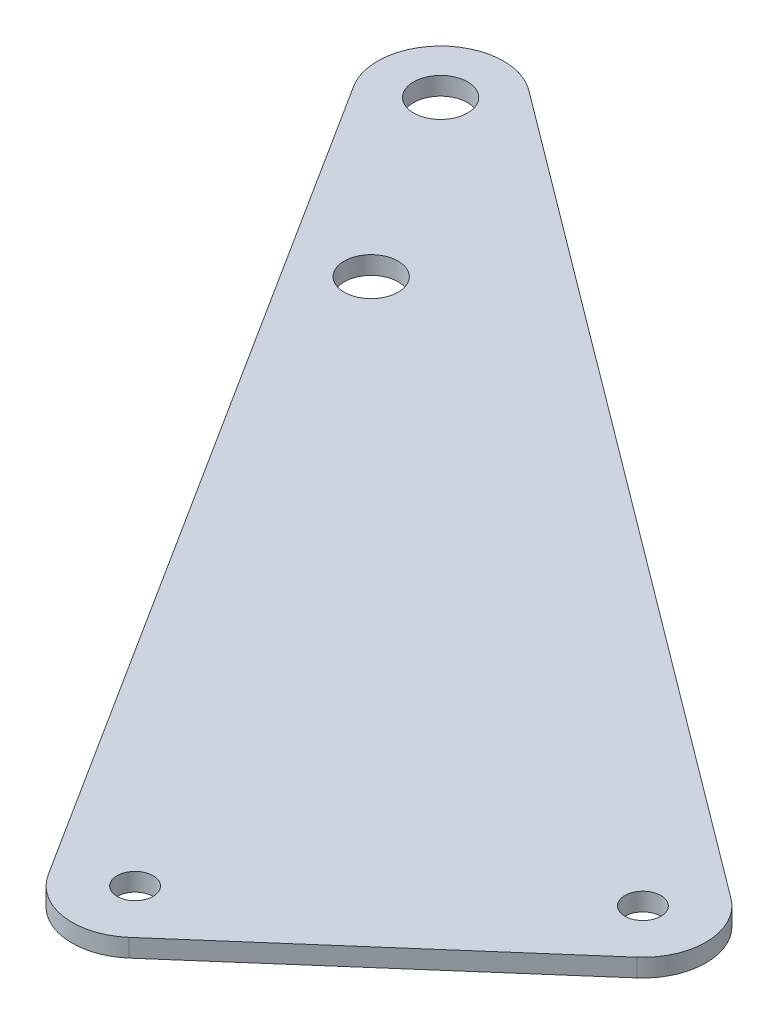
ISO-10303-21;
HEADER;
FILE_DESCRIPTION(('STEP AP214'),'2;1');
FILE_NAME('part.step','',(''),(''),'','','');
FILE_SCHEMA(('AUTOMOTIVE_DESIGN { 1 0 10303 214 1 1 1 1 }'));
ENDSEC;
DATA;
#1=APPLICATION_CONTEXT('core data for automotive mechanical design processes');
#2=APPLICATION_PROTOCOL_DEFINITION('international standard','automotive_design',2000,#1);
#3=PRODUCT_CONTEXT('',#1,'mechanical');
#4=PRODUCT('Part','Part','',(#3));
#5=PRODUCT_RELATED_PRODUCT_CATEGORY('part','',(#4));
#6=PRODUCT_DEFINITION_FORMATION('','',#4);
#7=PRODUCT_DEFINITION_CONTEXT('part definition',#1,'design');
#8=PRODUCT_DEFINITION('design','',#6,#7);
#9=PRODUCT_DEFINITION_SHAPE('','',#8);
#10=(LENGTH_UNIT() NAMED_UNIT(*) SI_UNIT(.MILLI.,.METRE.));
#11=(NAMED_UNIT(*) PLANE_ANGLE_UNIT() SI_UNIT($,.RADIAN.));
#12=(NAMED_UNIT(*) SI_UNIT($,.STERADIAN.) SOLID_ANGLE_UNIT());
#13=UNCERTAINTY_MEASURE_WITH_UNIT(LENGTH_MEASURE(1.E-05),#10,'distance_accuracy_value','');
#14=(GEOMETRIC_REPRESENTATION_CONTEXT(3) GLOBAL_UNCERTAINTY_ASSIGNED_CONTEXT((#13)) GLOBAL_UNIT_ASSIGNED_CONTEXT((#10,
#11,#12)) REPRESENTATION_CONTEXT('',''));
#15=CARTESIAN_POINT('',(0.,0.,0.));
#16=DIRECTION('',(0.,0.,1.));
#17=DIRECTION('',(1.,0.,0.));
#18=AXIS2_PLACEMENT_3D('',#15,#16,#17);
#19=CARTESIAN_POINT('',(1696.36798293908,2.,-948.360954862858));
#20=DIRECTION('',(0.,1.,0.));
#21=DIRECTION('',(0.,0.,-1.));
#22=AXIS2_PLACEMENT_3D('',#19,#20,#21);
#23=PLANE('',#22);
#24=CARTESIAN_POINT('',(1696.36798293908,2.,-948.360954862858));
#25=DIRECTION('',(0.,-1.,0.));
#26=DIRECTION('',(0.,0.,-1.));
#27=AXIS2_PLACEMENT_3D('',#24,#25,#26);
#28=CIRCLE('',#27,2.99999999999994);
#29=CARTESIAN_POINT('',(1696.36798293908,2.,-951.360954862858));
#30=VERTEX_POINT('',#29);
#31=EDGE_CURVE('E160',#30,#30,#28,.T.);
#32=ORIENTED_EDGE('',*,*,#31,.T.);
#33=EDGE_LOOP('',(#32));
#34=FACE_BOUND('',#33,.T.);
#35=CARTESIAN_POINT('',(1755.29624866515,2.,-855.476836206733));
#36=DIRECTION('',(0.,-1.,0.));
#37=DIRECTION('',(0.,0.,-1.));
#38=AXIS2_PLACEMENT_3D('',#35,#36,#37);
#39=CIRCLE('',#38,2.0000000000001);
#40=CARTESIAN_POINT('',(1755.29624866515,2.,-857.476836206733));
#41=VERTEX_POINT('',#40);
#42=EDGE_CURVE('E126',#41,#41,#39,.T.);
#43=ORIENTED_EDGE('',*,*,#42,.T.);
#44=EDGE_LOOP('',(#43));
#45=FACE_BOUND('',#44,.T.);
#46=CARTESIAN_POINT('',(1696.36798293908,2.,-948.360954862858));
#47=DIRECTION('',(0.,-1.,0.));
#48=DIRECTION('',(0.,0.,-1.));
#49=AXIS2_PLACEMENT_3D('',#46,#47,#48);
#50=CIRCLE('',#49,7.00000000000001);
#51=CARTESIAN_POINT('',(1690.45717538824,2.,-944.610974316654));
#52=VERTEX_POINT('',#51);
#53=CARTESIAN_POINT('',(1700.55912281539,2.,-953.967589016899));
#54=VERTEX_POINT('',#53);
#55=EDGE_CURVE('E137',#52,#54,#50,.T.);
#56=ORIENTED_EDGE('',*,*,#55,.F.);
#57=DIRECTION('',(-0.535711506600463,0.,-0.844401078691792));
#58=VECTOR('',#57,1.);
#59=CARTESIAN_POINT('',(1690.45717538824,2.,-944.610974316654));
#60=LINE('',#59,#58);
#61=CARTESIAN_POINT('',(1749.38544111431,2.,-851.726855660529));
#62=VERTEX_POINT('',#61);
#63=EDGE_CURVE('E117',#62,#52,#60,.T.);
#64=ORIENTED_EDGE('',*,*,#63,.F.);
#65=CARTESIAN_POINT('',(1755.29624866515,2.,-855.476836206733));
#66=DIRECTION('',(0.,-1.,0.));
#67=DIRECTION('',(0.,0.,-1.));
#68=AXIS2_PLACEMENT_3D('',#65,#66,#67);
#69=CIRCLE('',#68,6.99999999999992);
#70=CARTESIAN_POINT('',(1759.90080197654,2.,-850.204446918886));
#71=VERTEX_POINT('',#70);
#72=EDGE_CURVE('E98',#71,#62,#69,.T.);
#73=ORIENTED_EDGE('',*,*,#72,.F.);
#74=DIRECTION('',(-0.753198469692406,0.,0.657793330198033));
#75=VECTOR('',#74,1.);
#76=CARTESIAN_POINT('',(1790.02874076423,2.,-876.516180126807));
#77=LINE('',#76,#75);
#78=CARTESIAN_POINT('',(1790.02874076423,2.,-876.516180126807));
#79=VERTEX_POINT('',#78);
#80=EDGE_CURVE('E108',#79,#71,#77,.T.);
#81=ORIENTED_EDGE('',*,*,#80,.F.);
#82=CARTESIAN_POINT('',(1785.42418745285,2.,-881.788569414654));
#83=DIRECTION('',(0.,-1.,0.));
#84=DIRECTION('',(0.,0.,-1.));
#85=AXIS2_PLACEMENT_3D('',#82,#83,#84);
#86=CIRCLE('',#85,6.99999999999997);
#87=CARTESIAN_POINT('',(1789.61532732915,2.,-887.395203568695));
#88=VERTEX_POINT('',#87);
#89=EDGE_CURVE('E113',#88,#79,#86,.T.);
#90=ORIENTED_EDGE('',*,*,#89,.F.);
#91=DIRECTION('',(0.800947736291568,0.,0.598734268043356));
#92=VECTOR('',#91,1.);
#93=CARTESIAN_POINT('',(1700.55912281539,2.,-953.967589016899));
#94=LINE('',#93,#92);
#95=EDGE_CURVE('E142',#54,#88,#94,.T.);
#96=ORIENTED_EDGE('',*,*,#95,.F.);
#97=EDGE_LOOP('',(#56,#64,#73,#81,#90,#96));
#98=FACE_BOUND('',#97,.T.);
#99=CARTESIAN_POINT('',(1785.42418745285,2.,-881.788569414654));
#100=DIRECTION('',(0.,-1.,0.));
#101=DIRECTION('',(0.,0.,-1.));
#102=AXIS2_PLACEMENT_3D('',#99,#100,#101);
#103=CIRCLE('',#102,2.0000000000001);
#104=CARTESIAN_POINT('',(1785.42418745285,2.,-883.788569414654));
#105=VERTEX_POINT('',#104);
#106=EDGE_CURVE('E154',#105,#105,#103,.T.);
#107=ORIENTED_EDGE('',*,*,#106,.T.);
#108=EDGE_LOOP('',(#107));
#109=FACE_BOUND('',#108,.T.);
#110=CARTESIAN_POINT('',(1709.76077060409,2.,-927.250927895563));
#111=DIRECTION('',(0.,-1.,0.));
#112=DIRECTION('',(0.,0.,-1.));
#113=AXIS2_PLACEMENT_3D('',#110,#111,#112);
#114=CIRCLE('',#113,2.99999999999994);
#115=CARTESIAN_POINT('',(1709.76077060409,2.,-930.250927895563));
#116=VERTEX_POINT('',#115);
#117=EDGE_CURVE('E166',#116,#116,#114,.T.);
#118=ORIENTED_EDGE('',*,*,#117,.T.);
#119=EDGE_LOOP('',(#118));
#120=FACE_BOUND('',#119,.T.);
#121=ADVANCED_FACE('F37',(#34,#45,#98,#109,#120),#23,.T.);
#122=CARTESIAN_POINT('',(1696.36798293908,0.,-948.360954862858));
#123=DIRECTION('',(0.,1.,0.));
#124=DIRECTION('',(0.,0.,-1.));
#125=AXIS2_PLACEMENT_3D('',#122,#123,#124);
#126=PLANE('',#125);
#127=CARTESIAN_POINT('',(1696.36798293908,0.,-948.360954862858));
#128=DIRECTION('',(0.,-1.,0.));
#129=DIRECTION('',(0.,0.,-1.));
#130=AXIS2_PLACEMENT_3D('',#127,#128,#129);
#131=CIRCLE('',#130,7.00000000000001);
#132=CARTESIAN_POINT('',(1690.45717538824,0.,-944.610974316654));
#133=VERTEX_POINT('',#132);
#134=CARTESIAN_POINT('',(1700.55912281539,0.,-953.967589016899));
#135=VERTEX_POINT('',#134);
#136=EDGE_CURVE('E122',#133,#135,#131,.T.);
#137=ORIENTED_EDGE('',*,*,#136,.T.);
#138=DIRECTION('',(0.800947736291568,0.,0.598734268043356));
#139=VECTOR('',#138,1.);
#140=CARTESIAN_POINT('',(1700.55912281539,0.,-953.967589016899));
#141=LINE('',#140,#139);
#142=CARTESIAN_POINT('',(1789.61532732915,0.,-887.395203568695));
#143=VERTEX_POINT('',#142);
#144=EDGE_CURVE('E125',#135,#143,#141,.T.);
#145=ORIENTED_EDGE('',*,*,#144,.T.);
#146=CARTESIAN_POINT('',(1785.42418745285,0.,-881.788569414654));
#147=DIRECTION('',(0.,-1.,0.));
#148=DIRECTION('',(0.,0.,-1.));
#149=AXIS2_PLACEMENT_3D('',#146,#147,#148);
#150=CIRCLE('',#149,6.99999999999997);
#151=CARTESIAN_POINT('',(1790.02874076423,0.,-876.516180126807));
#152=VERTEX_POINT('',#151);
#153=EDGE_CURVE('E129',#143,#152,#150,.T.);
#154=ORIENTED_EDGE('',*,*,#153,.T.);
#155=DIRECTION('',(-0.753198469692406,0.,0.657793330198033));
#156=VECTOR('',#155,1.);
#157=CARTESIAN_POINT('',(1790.02874076423,0.,-876.516180126807));
#158=LINE('',#157,#156);
#159=CARTESIAN_POINT('',(1759.90080197654,0.,-850.204446918886));
#160=VERTEX_POINT('',#159);
#161=EDGE_CURVE('E132',#152,#160,#158,.T.);
#162=ORIENTED_EDGE('',*,*,#161,.T.);
#163=CARTESIAN_POINT('',(1755.29624866515,0.,-855.476836206733));
#164=DIRECTION('',(0.,-1.,0.));
#165=DIRECTION('',(0.,0.,-1.));
#166=AXIS2_PLACEMENT_3D('',#163,#164,#165);
#167=CIRCLE('',#166,6.99999999999992);
#168=CARTESIAN_POINT('',(1749.38544111431,0.,-851.726855660529));
#169=VERTEX_POINT('',#168);
#170=EDGE_CURVE('E101',#160,#169,#167,.T.);
#171=ORIENTED_EDGE('',*,*,#170,.T.);
#172=DIRECTION('',(-0.535711506600463,0.,-0.844401078691792));
#173=VECTOR('',#172,1.);
#174=CARTESIAN_POINT('',(1690.45717538824,0.,-944.610974316654));
#175=LINE('',#174,#173);
#176=EDGE_CURVE('E135',#169,#133,#175,.T.);
#177=ORIENTED_EDGE('',*,*,#176,.T.);
#178=EDGE_LOOP('',(#137,#145,#154,#162,#171,#177));
#179=FACE_BOUND('',#178,.T.);
#180=CARTESIAN_POINT('',(1755.29624866515,0.,-855.476836206733));
#181=DIRECTION('',(0.,-1.,0.));
#182=DIRECTION('',(0.,0.,-1.));
#183=AXIS2_PLACEMENT_3D('',#180,#181,#182);
#184=CIRCLE('',#183,2.0000000000001);
#185=CARTESIAN_POINT('',(1755.29624866515,0.,-857.476836206733));
#186=VERTEX_POINT('',#185);
#187=EDGE_CURVE('E151',#186,#186,#184,.T.);
#188=ORIENTED_EDGE('',*,*,#187,.F.);
#189=EDGE_LOOP('',(#188));
#190=FACE_BOUND('',#189,.T.);
#191=CARTESIAN_POINT('',(1785.42418745285,0.,-881.788569414654));
#192=DIRECTION('',(0.,-1.,0.));
#193=DIRECTION('',(0.,0.,-1.));
#194=AXIS2_PLACEMENT_3D('',#191,#192,#193);
#195=CIRCLE('',#194,2.0000000000001);
#196=CARTESIAN_POINT('',(1785.42418745285,0.,-883.788569414654));
#197=VERTEX_POINT('',#196);
#198=EDGE_CURVE('E157',#197,#197,#195,.T.);
#199=ORIENTED_EDGE('',*,*,#198,.F.);
#200=EDGE_LOOP('',(#199));
#201=FACE_BOUND('',#200,.T.);
#202=CARTESIAN_POINT('',(1696.36798293908,0.,-948.360954862858));
#203=DIRECTION('',(0.,-1.,0.));
#204=DIRECTION('',(0.,0.,-1.));
#205=AXIS2_PLACEMENT_3D('',#202,#203,#204);
#206=CIRCLE('',#205,2.99999999999994);
#207=CARTESIAN_POINT('',(1696.36798293908,0.,-951.360954862858));
#208=VERTEX_POINT('',#207);
#209=EDGE_CURVE('E163',#208,#208,#206,.T.);
#210=ORIENTED_EDGE('',*,*,#209,.F.);
#211=EDGE_LOOP('',(#210));
#212=FACE_BOUND('',#211,.T.);
#213=CARTESIAN_POINT('',(1709.76077060409,0.,-927.250927895563));
#214=DIRECTION('',(0.,-1.,0.));
#215=DIRECTION('',(0.,0.,-1.));
#216=AXIS2_PLACEMENT_3D('',#213,#214,#215);
#217=CIRCLE('',#216,2.99999999999994);
#218=CARTESIAN_POINT('',(1709.76077060409,0.,-930.250927895563));
#219=VERTEX_POINT('',#218);
#220=EDGE_CURVE('E169',#219,#219,#217,.T.);
#221=ORIENTED_EDGE('',*,*,#220,.F.);
#222=EDGE_LOOP('',(#221));
#223=FACE_BOUND('',#222,.T.);
#224=ADVANCED_FACE('F146',(#179,#190,#201,#212,#223),#126,.F.);
#225=CARTESIAN_POINT('',(1696.36798293908,2.,-948.360954862858));
#226=DIRECTION('',(0.,-1.,0.));
#227=DIRECTION('',(0.,0.,1.));
#228=AXIS2_PLACEMENT_3D('',#225,#226,#227);
#229=CYLINDRICAL_SURFACE('',#228,7.00000000000001);
#230=ORIENTED_EDGE('',*,*,#136,.F.);
#231=DIRECTION('',(0.,-1.,0.));
#232=VECTOR('',#231,1.);
#233=CARTESIAN_POINT('',(1690.45717538824,2.,-944.610974316654));
#234=LINE('',#233,#232);
#235=EDGE_CURVE('E54',#52,#133,#234,.T.);
#236=ORIENTED_EDGE('',*,*,#235,.F.);
#237=ORIENTED_EDGE('',*,*,#55,.T.);
#238=DIRECTION('',(0.,-1.,0.));
#239=VECTOR('',#238,1.);
#240=CARTESIAN_POINT('',(1700.55912281539,2.,-953.967589016899));
#241=LINE('',#240,#239);
#242=EDGE_CURVE('E11',#54,#135,#241,.T.);
#243=ORIENTED_EDGE('',*,*,#242,.T.);
#244=EDGE_LOOP('',(#230,#236,#237,#243));
#245=FACE_BOUND('',#244,.T.);
#246=ADVANCED_FACE('F39',(#245),#229,.T.);
#247=CARTESIAN_POINT('',(1700.55912281539,2.,-953.967589016899));
#248=DIRECTION('',(-0.598734268043356,0.,0.800947736291568));
#249=DIRECTION('',(-0.800947736291568,0.,-0.598734268043356));
#250=AXIS2_PLACEMENT_3D('',#247,#248,#249);
#251=PLANE('',#250);
#252=ORIENTED_EDGE('',*,*,#144,.F.);
#253=ORIENTED_EDGE('',*,*,#242,.F.);
#254=ORIENTED_EDGE('',*,*,#95,.T.);
#255=DIRECTION('',(0.,-1.,0.));
#256=VECTOR('',#255,1.);
#257=CARTESIAN_POINT('',(1789.61532732915,2.,-887.395203568695));
#258=LINE('',#257,#256);
#259=EDGE_CURVE('E46',#88,#143,#258,.T.);
#260=ORIENTED_EDGE('',*,*,#259,.T.);
#261=EDGE_LOOP('',(#252,#253,#254,#260));
#262=FACE_BOUND('',#261,.T.);
#263=ADVANCED_FACE('F141',(#262),#251,.F.);
#264=CARTESIAN_POINT('',(1785.42418745285,2.,-881.788569414654));
#265=DIRECTION('',(0.,-1.,0.));
#266=DIRECTION('',(0.,0.,1.));
#267=AXIS2_PLACEMENT_3D('',#264,#265,#266);
#268=CYLINDRICAL_SURFACE('',#267,6.99999999999997);
#269=ORIENTED_EDGE('',*,*,#153,.F.);
#270=ORIENTED_EDGE('',*,*,#259,.F.);
#271=ORIENTED_EDGE('',*,*,#89,.T.);
#272=DIRECTION('',(0.,-1.,0.));
#273=VECTOR('',#272,1.);
#274=CARTESIAN_POINT('',(1790.02874076423,2.,-876.516180126807));
#275=LINE('',#274,#273);
#276=EDGE_CURVE('E105',#79,#152,#275,.T.);
#277=ORIENTED_EDGE('',*,*,#276,.T.);
#278=EDGE_LOOP('',(#269,#270,#271,#277));
#279=FACE_BOUND('',#278,.T.);
#280=ADVANCED_FACE('F144',(#279),#268,.T.);
#281=CARTESIAN_POINT('',(1790.02874076423,2.,-876.516180126807));
#282=DIRECTION('',(-0.657793330198033,0.,-0.753198469692406));
#283=DIRECTION('',(0.753198469692406,0.,-0.657793330198033));
#284=AXIS2_PLACEMENT_3D('',#281,#282,#283);
#285=PLANE('',#284);
#286=ORIENTED_EDGE('',*,*,#161,.F.);
#287=ORIENTED_EDGE('',*,*,#276,.F.);
#288=ORIENTED_EDGE('',*,*,#80,.T.);
#289=DIRECTION('',(0.,-1.,0.));
#290=VECTOR('',#289,1.);
#291=CARTESIAN_POINT('',(1759.90080197654,2.,-850.204446918886));
#292=LINE('',#291,#290);
#293=EDGE_CURVE('E94',#71,#160,#292,.T.);
#294=ORIENTED_EDGE('',*,*,#293,.T.);
#295=EDGE_LOOP('',(#286,#287,#288,#294));
#296=FACE_BOUND('',#295,.T.);
#297=ADVANCED_FACE('F109',(#296),#285,.F.);
#298=CARTESIAN_POINT('',(1755.29624866515,2.,-855.476836206733));
#299=DIRECTION('',(0.,-1.,0.));
#300=DIRECTION('',(0.,0.,1.));
#301=AXIS2_PLACEMENT_3D('',#298,#299,#300);
#302=CYLINDRICAL_SURFACE('',#301,6.99999999999992);
#303=ORIENTED_EDGE('',*,*,#170,.F.);
#304=ORIENTED_EDGE('',*,*,#293,.F.);
#305=ORIENTED_EDGE('',*,*,#72,.T.);
#306=DIRECTION('',(0.,-1.,0.));
#307=VECTOR('',#306,1.);
#308=CARTESIAN_POINT('',(1749.38544111431,2.,-851.726855660529));
#309=LINE('',#308,#307);
#310=EDGE_CURVE('E76',#62,#169,#309,.T.);
#311=ORIENTED_EDGE('',*,*,#310,.T.);
#312=EDGE_LOOP('',(#303,#304,#305,#311));
#313=FACE_BOUND('',#312,.T.);
#314=ADVANCED_FACE('F96',(#313),#302,.T.);
#315=CARTESIAN_POINT('',(1690.45717538824,2.,-944.610974316654));
#316=DIRECTION('',(0.844401078691792,0.,-0.535711506600463));
#317=DIRECTION('',(0.535711506600463,0.,0.844401078691792));
#318=AXIS2_PLACEMENT_3D('',#315,#316,#317);
#319=PLANE('',#318);
#320=ORIENTED_EDGE('',*,*,#176,.F.);
#321=ORIENTED_EDGE('',*,*,#310,.F.);
#322=ORIENTED_EDGE('',*,*,#63,.T.);
#323=ORIENTED_EDGE('',*,*,#235,.T.);
#324=EDGE_LOOP('',(#320,#321,#322,#323));
#325=FACE_BOUND('',#324,.T.);
#326=ADVANCED_FACE('F193',(#325),#319,.F.);
#327=CARTESIAN_POINT('',(1755.29624866515,2.,-855.476836206733));
#328=DIRECTION('',(0.,-1.,0.));
#329=DIRECTION('',(0.,0.,1.));
#330=AXIS2_PLACEMENT_3D('',#327,#328,#329);
#331=CYLINDRICAL_SURFACE('',#330,2.0000000000001);
#332=ORIENTED_EDGE('',*,*,#42,.F.);
#333=EDGE_LOOP('',(#332));
#334=FACE_BOUND('',#333,.T.);
#335=ORIENTED_EDGE('',*,*,#187,.T.);
#336=EDGE_LOOP('',(#335));
#337=FACE_BOUND('',#336,.T.);
#338=ADVANCED_FACE('F196',(#334,#337),#331,.F.);
#339=CARTESIAN_POINT('',(1785.42418745285,2.,-881.788569414654));
#340=DIRECTION('',(0.,-1.,0.));
#341=DIRECTION('',(0.,0.,1.));
#342=AXIS2_PLACEMENT_3D('',#339,#340,#341);
#343=CYLINDRICAL_SURFACE('',#342,2.0000000000001);
#344=ORIENTED_EDGE('',*,*,#106,.F.);
#345=EDGE_LOOP('',(#344));
#346=FACE_BOUND('',#345,.T.);
#347=ORIENTED_EDGE('',*,*,#198,.T.);
#348=EDGE_LOOP('',(#347));
#349=FACE_BOUND('',#348,.T.);
#350=ADVANCED_FACE('F229',(#346,#349),#343,.F.);
#351=CARTESIAN_POINT('',(1696.36798293908,2.,-948.360954862858));
#352=DIRECTION('',(0.,-1.,0.));
#353=DIRECTION('',(0.,0.,1.));
#354=AXIS2_PLACEMENT_3D('',#351,#352,#353);
#355=CYLINDRICAL_SURFACE('',#354,2.99999999999994);
#356=ORIENTED_EDGE('',*,*,#31,.F.);
#357=EDGE_LOOP('',(#356));
#358=FACE_BOUND('',#357,.T.);
#359=ORIENTED_EDGE('',*,*,#209,.T.);
#360=EDGE_LOOP('',(#359));
#361=FACE_BOUND('',#360,.T.);
#362=ADVANCED_FACE('F179',(#358,#361),#355,.F.);
#363=CARTESIAN_POINT('',(1709.76077060409,2.,-927.250927895563));
#364=DIRECTION('',(0.,-1.,0.));
#365=DIRECTION('',(0.,0.,1.));
#366=AXIS2_PLACEMENT_3D('',#363,#364,#365);
#367=CYLINDRICAL_SURFACE('',#366,2.99999999999994);
#368=ORIENTED_EDGE('',*,*,#117,.F.);
#369=EDGE_LOOP('',(#368));
#370=FACE_BOUND('',#369,.T.);
#371=ORIENTED_EDGE('',*,*,#220,.T.);
#372=EDGE_LOOP('',(#371));
#373=FACE_BOUND('',#372,.T.);
#374=ADVANCED_FACE('F176',(#370,#373),#367,.F.);
#375=CLOSED_SHELL('',(#121,#224,#246,#263,#280,#297,#314,#326,#338,#350,#362,#374));
#376=MANIFOLD_SOLID_BREP('B2',#375);
#377=ADVANCED_BREP_SHAPE_REPRESENTATION('',(#18,#376),#14);
#378=SHAPE_DEFINITION_REPRESENTATION(#9,#377);
ENDSEC;
END-ISO-10303-21;
